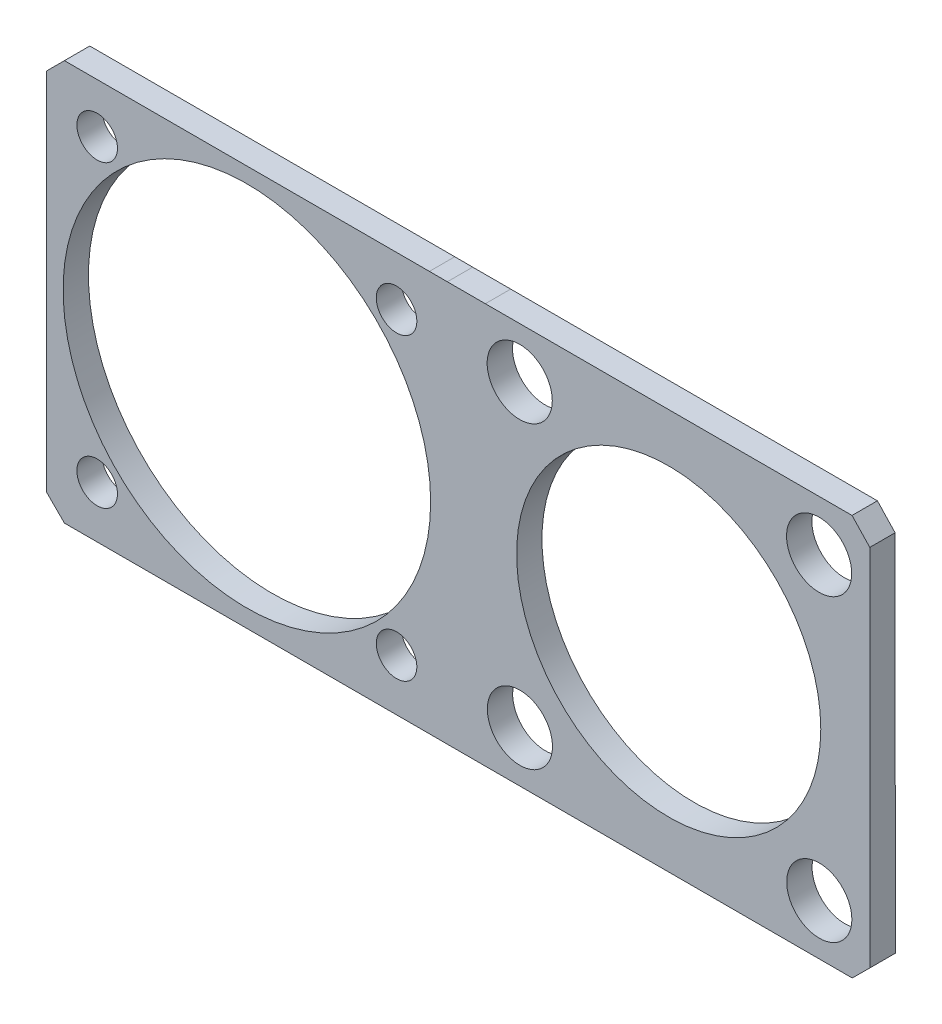
ISO-10303-21;
HEADER;
FILE_DESCRIPTION(('STEP AP214'),'2;1');
FILE_NAME('part.step','',(''),(''),'','','');
FILE_SCHEMA(('AUTOMOTIVE_DESIGN { 1 0 10303 214 1 1 1 1 }'));
ENDSEC;
DATA;
#1=APPLICATION_CONTEXT('core data for automotive mechanical design processes');
#2=APPLICATION_PROTOCOL_DEFINITION('international standard','automotive_design',2000,#1);
#3=PRODUCT_CONTEXT('',#1,'mechanical');
#4=PRODUCT('Part','Part','',(#3));
#5=PRODUCT_RELATED_PRODUCT_CATEGORY('part','',(#4));
#6=PRODUCT_DEFINITION_FORMATION('','',#4);
#7=PRODUCT_DEFINITION_CONTEXT('part definition',#1,'design');
#8=PRODUCT_DEFINITION('design','',#6,#7);
#9=PRODUCT_DEFINITION_SHAPE('','',#8);
#10=(LENGTH_UNIT() NAMED_UNIT(*) SI_UNIT(.MILLI.,.METRE.));
#11=(NAMED_UNIT(*) PLANE_ANGLE_UNIT() SI_UNIT($,.RADIAN.));
#12=(NAMED_UNIT(*) SI_UNIT($,.STERADIAN.) SOLID_ANGLE_UNIT());
#13=UNCERTAINTY_MEASURE_WITH_UNIT(LENGTH_MEASURE(1.E-05),#10,'distance_accuracy_value','');
#14=(GEOMETRIC_REPRESENTATION_CONTEXT(3) GLOBAL_UNCERTAINTY_ASSIGNED_CONTEXT((#13)) GLOBAL_UNIT_ASSIGNED_CONTEXT((#10,
#11,#12)) REPRESENTATION_CONTEXT('',''));
#15=CARTESIAN_POINT('',(0.,0.,0.));
#16=DIRECTION('',(0.,0.,1.));
#17=DIRECTION('',(1.,0.,0.));
#18=AXIS2_PLACEMENT_3D('',#15,#16,#17);
#19=CARTESIAN_POINT('',(0.,-20.1814452506388,-2.54));
#20=DIRECTION('',(0.,-1.,0.));
#21=DIRECTION('',(0.,0.,-1.));
#22=AXIS2_PLACEMENT_3D('',#19,#20,#21);
#23=PLANE('',#22);
#24=DIRECTION('',(1.,0.,0.));
#25=VECTOR('',#24,1.);
#26=CARTESIAN_POINT('',(0.,-20.1814452506388,0.));
#27=LINE('',#26,#25);
#28=CARTESIAN_POINT('',(20.066,-20.1814452506388,0.));
#29=VERTEX_POINT('',#28);
#30=CARTESIAN_POINT('',(60.660238164582,-20.1814452506388,0.));
#31=VERTEX_POINT('',#30);
#32=EDGE_CURVE('E215',#29,#31,#27,.T.);
#33=ORIENTED_EDGE('',*,*,#32,.F.);
#34=DIRECTION('',(0.,0.,1.));
#35=VECTOR('',#34,1.);
#36=CARTESIAN_POINT('',(20.066,-20.1814452506388,-2.54));
#37=LINE('',#36,#35);
#38=CARTESIAN_POINT('',(20.066,-20.1814452506388,-2.54));
#39=VERTEX_POINT('',#38);
#40=EDGE_CURVE('E11',#39,#29,#37,.T.);
#41=ORIENTED_EDGE('',*,*,#40,.F.);
#42=DIRECTION('',(1.,0.,0.));
#43=VECTOR('',#42,1.);
#44=CARTESIAN_POINT('',(0.,-20.1814452506388,-2.54));
#45=LINE('',#44,#43);
#46=CARTESIAN_POINT('',(60.660238164582,-20.1814452506388,-2.54));
#47=VERTEX_POINT('',#46);
#48=EDGE_CURVE('E293',#39,#47,#45,.T.);
#49=ORIENTED_EDGE('',*,*,#48,.T.);
#50=DIRECTION('',(0.,0.,1.));
#51=VECTOR('',#50,1.);
#52=CARTESIAN_POINT('',(60.660238164582,-20.1814452506388,-2.54));
#53=LINE('',#52,#51);
#54=EDGE_CURVE('E45',#47,#31,#53,.T.);
#55=ORIENTED_EDGE('',*,*,#54,.T.);
#56=EDGE_LOOP('',(#33,#41,#49,#55));
#57=FACE_BOUND('',#56,.T.);
#58=ADVANCED_FACE('F41',(#57),#23,.T.);
#59=CARTESIAN_POINT('',(-0.0561228319052938,-20.1253313662649,-2.54));
#60=DIRECTION('',(-0.00278865538465469,-0.999996111693013,0.));
#61=DIRECTION('',(0.999996111693013,-0.00278865538465469,0.));
#62=AXIS2_PLACEMENT_3D('',#59,#60,#61);
#63=PLANE('',#62);
#64=DIRECTION('',(0.999996111693014,-0.00278865538465469,0.));
#65=VECTOR('',#64,1.);
#66=CARTESIAN_POINT('',(-0.0561228319052938,-20.1253313662649,0.));
#67=LINE('',#66,#65);
#68=CARTESIAN_POINT('',(18.2929444601042,-20.1765007905346,0.));
#69=VERTEX_POINT('',#68);
#70=EDGE_CURVE('E260',#69,#29,#67,.T.);
#71=ORIENTED_EDGE('',*,*,#70,.F.);
#72=DIRECTION('',(0.,0.,1.));
#73=VECTOR('',#72,1.);
#74=CARTESIAN_POINT('',(18.2929444601042,-20.1765007905346,-2.54));
#75=LINE('',#74,#73);
#76=CARTESIAN_POINT('',(18.2929444601042,-20.1765007905346,-2.54));
#77=VERTEX_POINT('',#76);
#78=EDGE_CURVE('E52',#77,#69,#75,.T.);
#79=ORIENTED_EDGE('',*,*,#78,.F.);
#80=DIRECTION('',(0.999996111693014,-0.00278865538465469,0.));
#81=VECTOR('',#80,1.);
#82=CARTESIAN_POINT('',(-0.0561228319052938,-20.1253313662649,-2.54));
#83=LINE('',#82,#81);
#84=EDGE_CURVE('E161',#77,#39,#83,.T.);
#85=ORIENTED_EDGE('',*,*,#84,.T.);
#86=ORIENTED_EDGE('',*,*,#40,.T.);
#87=EDGE_LOOP('',(#71,#79,#85,#86));
#88=FACE_BOUND('',#87,.T.);
#89=ADVANCED_FACE('F297',(#88),#63,.T.);
#90=CARTESIAN_POINT('',(0.,-20.1765007905346,-2.54));
#91=DIRECTION('',(0.,-1.,0.));
#92=DIRECTION('',(0.,0.,-1.));
#93=AXIS2_PLACEMENT_3D('',#90,#91,#92);
#94=PLANE('',#93);
#95=DIRECTION('',(1.,0.,0.));
#96=VECTOR('',#95,1.);
#97=CARTESIAN_POINT('',(0.,-20.1765007905346,0.));
#98=LINE('',#97,#96);
#99=CARTESIAN_POINT('',(-18.2830555398958,-20.1765007905345,0.));
#100=VERTEX_POINT('',#99);
#101=EDGE_CURVE('E147',#100,#69,#98,.T.);
#102=ORIENTED_EDGE('',*,*,#101,.F.);
#103=DIRECTION('',(0.,0.,1.));
#104=VECTOR('',#103,1.);
#105=CARTESIAN_POINT('',(-18.2830555398958,-20.1765007905345,-2.54));
#106=LINE('',#105,#104);
#107=CARTESIAN_POINT('',(-18.2830555398958,-20.1765007905345,-2.54));
#108=VERTEX_POINT('',#107);
#109=EDGE_CURVE('E142',#108,#100,#106,.T.);
#110=ORIENTED_EDGE('',*,*,#109,.F.);
#111=DIRECTION('',(1.,0.,0.));
#112=VECTOR('',#111,1.);
#113=CARTESIAN_POINT('',(0.,-20.1765007905346,-2.54));
#114=LINE('',#113,#112);
#115=EDGE_CURVE('E145',#108,#77,#114,.T.);
#116=ORIENTED_EDGE('',*,*,#115,.T.);
#117=ORIENTED_EDGE('',*,*,#78,.T.);
#118=EDGE_LOOP('',(#102,#110,#116,#117));
#119=FACE_BOUND('',#118,.T.);
#120=ADVANCED_FACE('F144',(#119),#94,.T.);
#121=CARTESIAN_POINT('',(-19.2297781652152,-19.2297781652152,-2.54));
#122=DIRECTION('',(-0.707106781186548,-0.707106781186548,0.));
#123=DIRECTION('',(0.707106781186548,-0.707106781186548,0.));
#124=AXIS2_PLACEMENT_3D('',#121,#122,#123);
#125=PLANE('',#124);
#126=DIRECTION('',(0.707106781186548,-0.707106781186548,0.));
#127=VECTOR('',#126,1.);
#128=CARTESIAN_POINT('',(-19.2297781652152,-19.2297781652152,0.));
#129=LINE('',#128,#127);
#130=CARTESIAN_POINT('',(-20.0610555398958,-18.3985007905345,0.));
#131=VERTEX_POINT('',#130);
#132=EDGE_CURVE('E255',#131,#100,#129,.T.);
#133=ORIENTED_EDGE('',*,*,#132,.F.);
#134=DIRECTION('',(0.,0.,1.));
#135=VECTOR('',#134,1.);
#136=CARTESIAN_POINT('',(-20.0610555398958,-18.3985007905345,-2.54));
#137=LINE('',#136,#135);
#138=CARTESIAN_POINT('',(-20.0610555398958,-18.3985007905345,-2.54));
#139=VERTEX_POINT('',#138);
#140=EDGE_CURVE('E153',#139,#131,#137,.T.);
#141=ORIENTED_EDGE('',*,*,#140,.F.);
#142=DIRECTION('',(0.707106781186548,-0.707106781186548,0.));
#143=VECTOR('',#142,1.);
#144=CARTESIAN_POINT('',(-19.2297781652152,-19.2297781652152,-2.54));
#145=LINE('',#144,#143);
#146=EDGE_CURVE('E159',#139,#108,#145,.T.);
#147=ORIENTED_EDGE('',*,*,#146,.T.);
#148=ORIENTED_EDGE('',*,*,#109,.T.);
#149=EDGE_LOOP('',(#133,#141,#147,#148));
#150=FACE_BOUND('',#149,.T.);
#151=ADVANCED_FACE('F164',(#150),#125,.T.);
#152=CARTESIAN_POINT('',(-20.0610555398958,0.,-2.54));
#153=DIRECTION('',(-1.,0.,0.));
#154=DIRECTION('',(0.,0.,1.));
#155=AXIS2_PLACEMENT_3D('',#152,#153,#154);
#156=PLANE('',#155);
#157=DIRECTION('',(0.,-1.,0.));
#158=VECTOR('',#157,1.);
#159=CARTESIAN_POINT('',(-20.0610555398958,0.,0.));
#160=LINE('',#159,#158);
#161=CARTESIAN_POINT('',(-20.0610555398958,18.1774992094654,0.));
#162=VERTEX_POINT('',#161);
#163=EDGE_CURVE('E251',#162,#131,#160,.T.);
#164=ORIENTED_EDGE('',*,*,#163,.F.);
#165=DIRECTION('',(0.,0.,1.));
#166=VECTOR('',#165,1.);
#167=CARTESIAN_POINT('',(-20.0610555398958,18.1774992094654,-2.54));
#168=LINE('',#167,#166);
#169=CARTESIAN_POINT('',(-20.0610555398958,18.1774992094654,-2.54));
#170=VERTEX_POINT('',#169);
#171=EDGE_CURVE('E269',#170,#162,#168,.T.);
#172=ORIENTED_EDGE('',*,*,#171,.F.);
#173=DIRECTION('',(0.,-1.,0.));
#174=VECTOR('',#173,1.);
#175=CARTESIAN_POINT('',(-20.0610555398958,0.,-2.54));
#176=LINE('',#175,#174);
#177=EDGE_CURVE('E166',#170,#139,#176,.T.);
#178=ORIENTED_EDGE('',*,*,#177,.T.);
#179=ORIENTED_EDGE('',*,*,#140,.T.);
#180=EDGE_LOOP('',(#164,#172,#178,#179));
#181=FACE_BOUND('',#180,.T.);
#182=ADVANCED_FACE('F311',(#181),#156,.T.);
#183=CARTESIAN_POINT('',(-19.1192773746806,19.1192773746806,-2.54));
#184=DIRECTION('',(-0.707106781186548,0.707106781186548,0.));
#185=DIRECTION('',(-0.707106781186548,-0.707106781186548,0.));
#186=AXIS2_PLACEMENT_3D('',#183,#184,#185);
#187=PLANE('',#186);
#188=DIRECTION('',(-0.707106781186548,-0.707106781186548,0.));
#189=VECTOR('',#188,1.);
#190=CARTESIAN_POINT('',(-19.1192773746806,19.1192773746806,0.));
#191=LINE('',#190,#189);
#192=CARTESIAN_POINT('',(-18.2830555398958,19.9554992094655,0.));
#193=VERTEX_POINT('',#192);
#194=EDGE_CURVE('E247',#193,#162,#191,.T.);
#195=ORIENTED_EDGE('',*,*,#194,.F.);
#196=DIRECTION('',(0.,0.,1.));
#197=VECTOR('',#196,1.);
#198=CARTESIAN_POINT('',(-18.2830555398958,19.9554992094655,-2.54));
#199=LINE('',#198,#197);
#200=CARTESIAN_POINT('',(-18.2830555398958,19.9554992094655,-2.54));
#201=VERTEX_POINT('',#200);
#202=EDGE_CURVE('E272',#201,#193,#199,.T.);
#203=ORIENTED_EDGE('',*,*,#202,.F.);
#204=DIRECTION('',(-0.707106781186548,-0.707106781186548,0.));
#205=VECTOR('',#204,1.);
#206=CARTESIAN_POINT('',(-19.1192773746806,19.1192773746806,-2.54));
#207=LINE('',#206,#205);
#208=EDGE_CURVE('E169',#201,#170,#207,.T.);
#209=ORIENTED_EDGE('',*,*,#208,.T.);
#210=ORIENTED_EDGE('',*,*,#171,.T.);
#211=EDGE_LOOP('',(#195,#203,#209,#210));
#212=FACE_BOUND('',#211,.T.);
#213=ADVANCED_FACE('F314',(#212),#187,.T.);
#214=CARTESIAN_POINT('',(0.,19.9554992094655,-2.54));
#215=DIRECTION('',(0.,1.,0.));
#216=DIRECTION('',(0.,0.,1.));
#217=AXIS2_PLACEMENT_3D('',#214,#215,#216);
#218=PLANE('',#217);
#219=DIRECTION('',(-1.,0.,0.));
#220=VECTOR('',#219,1.);
#221=CARTESIAN_POINT('',(0.,19.9554992094655,0.));
#222=LINE('',#221,#220);
#223=CARTESIAN_POINT('',(18.2929444601042,19.9554992094655,0.));
#224=VERTEX_POINT('',#223);
#225=EDGE_CURVE('E243',#224,#193,#222,.T.);
#226=ORIENTED_EDGE('',*,*,#225,.F.);
#227=DIRECTION('',(0.,0.,1.));
#228=VECTOR('',#227,1.);
#229=CARTESIAN_POINT('',(18.2929444601042,19.9554992094655,-2.54));
#230=LINE('',#229,#228);
#231=CARTESIAN_POINT('',(18.2929444601042,19.9554992094655,-2.54));
#232=VERTEX_POINT('',#231);
#233=EDGE_CURVE('E275',#232,#224,#230,.T.);
#234=ORIENTED_EDGE('',*,*,#233,.F.);
#235=DIRECTION('',(-1.,0.,0.));
#236=VECTOR('',#235,1.);
#237=CARTESIAN_POINT('',(0.,19.9554992094655,-2.54));
#238=LINE('',#237,#236);
#239=EDGE_CURVE('E489',#232,#201,#238,.T.);
#240=ORIENTED_EDGE('',*,*,#239,.T.);
#241=ORIENTED_EDGE('',*,*,#202,.T.);
#242=EDGE_LOOP('',(#226,#234,#240,#241));
#243=FACE_BOUND('',#242,.T.);
#244=ADVANCED_FACE('F318',(#243),#218,.T.);
#245=CARTESIAN_POINT('',(0.0557910508343836,20.0063565432699,-2.54));
#246=DIRECTION('',(0.00278865538465168,0.999996111693013,0.));
#247=DIRECTION('',(-0.999996111693013,0.00278865538465168,0.));
#248=AXIS2_PLACEMENT_3D('',#245,#246,#247);
#249=PLANE('',#248);
#250=DIRECTION('',(-0.999996111693014,0.00278865538465168,0.));
#251=VECTOR('',#250,1.);
#252=CARTESIAN_POINT('',(0.0557910508343836,20.0063565432699,0.));
#253=LINE('',#252,#251);
#254=CARTESIAN_POINT('',(20.085777840816,19.9504995955645,0.));
#255=VERTEX_POINT('',#254);
#256=EDGE_CURVE('E239',#255,#224,#253,.T.);
#257=ORIENTED_EDGE('',*,*,#256,.F.);
#258=DIRECTION('',(0.,0.,1.));
#259=VECTOR('',#258,1.);
#260=CARTESIAN_POINT('',(20.085777840816,19.9504995955645,-2.54));
#261=LINE('',#260,#259);
#262=CARTESIAN_POINT('',(20.085777840816,19.9504995955645,-2.54));
#263=VERTEX_POINT('',#262);
#264=EDGE_CURVE('E278',#263,#255,#261,.T.);
#265=ORIENTED_EDGE('',*,*,#264,.F.);
#266=DIRECTION('',(-0.999996111693014,0.00278865538465168,0.));
#267=VECTOR('',#266,1.);
#268=CARTESIAN_POINT('',(0.0557910508343836,20.0063565432699,-2.54));
#269=LINE('',#268,#267);
#270=EDGE_CURVE('E485',#263,#232,#269,.T.);
#271=ORIENTED_EDGE('',*,*,#270,.T.);
#272=ORIENTED_EDGE('',*,*,#233,.T.);
#273=EDGE_LOOP('',(#257,#265,#271,#272));
#274=FACE_BOUND('',#273,.T.);
#275=ADVANCED_FACE('F322',(#274),#249,.T.);
#276=CARTESIAN_POINT('',(-0.000288800462674114,19.9502088284157,-2.54));
#277=DIRECTION('',(-1.44760621368788E-05,0.999999999895222,0.));
#278=DIRECTION('',(-0.999999999895222,-1.44760621368788E-05,0.));
#279=AXIS2_PLACEMENT_3D('',#276,#277,#278);
#280=PLANE('',#279);
#281=DIRECTION('',(-0.999999999895222,-1.44760621368788E-05,0.));
#282=VECTOR('',#281,1.);
#283=CARTESIAN_POINT('',(-0.000288800462674114,19.9502088284157,0.));
#284=LINE('',#283,#282);
#285=CARTESIAN_POINT('',(23.8957778404168,19.9505547493613,0.));
#286=VERTEX_POINT('',#285);
#287=EDGE_CURVE('E235',#286,#255,#284,.T.);
#288=ORIENTED_EDGE('',*,*,#287,.F.);
#289=DIRECTION('',(0.,0.,1.));
#290=VECTOR('',#289,1.);
#291=CARTESIAN_POINT('',(23.8957778404168,19.9505547493613,-2.54));
#292=LINE('',#291,#290);
#293=CARTESIAN_POINT('',(23.8957778404168,19.9505547493613,-2.54));
#294=VERTEX_POINT('',#293);
#295=EDGE_CURVE('E281',#294,#286,#292,.T.);
#296=ORIENTED_EDGE('',*,*,#295,.F.);
#297=DIRECTION('',(-0.999999999895222,-1.44760621368788E-05,0.));
#298=VECTOR('',#297,1.);
#299=CARTESIAN_POINT('',(-0.000288800462674114,19.9502088284157,-2.54));
#300=LINE('',#299,#298);
#301=EDGE_CURVE('E481',#294,#263,#300,.T.);
#302=ORIENTED_EDGE('',*,*,#301,.T.);
#303=ORIENTED_EDGE('',*,*,#264,.T.);
#304=EDGE_LOOP('',(#288,#296,#302,#303));
#305=FACE_BOUND('',#304,.T.);
#306=ADVANCED_FACE('F326',(#305),#280,.T.);
#307=CARTESIAN_POINT('',(0.,19.9505547493613,-2.54));
#308=DIRECTION('',(0.,1.,0.));
#309=DIRECTION('',(0.,0.,1.));
#310=AXIS2_PLACEMENT_3D('',#307,#308,#309);
#311=PLANE('',#310);
#312=DIRECTION('',(-1.,0.,0.));
#313=VECTOR('',#312,1.);
#314=CARTESIAN_POINT('',(0.,19.9505547493613,0.));
#315=LINE('',#314,#313);
#316=CARTESIAN_POINT('',(60.6404603241651,19.9505547493613,0.));
#317=VERTEX_POINT('',#316);
#318=EDGE_CURVE('E231',#317,#286,#315,.T.);
#319=ORIENTED_EDGE('',*,*,#318,.F.);
#320=DIRECTION('',(0.,0.,1.));
#321=VECTOR('',#320,1.);
#322=CARTESIAN_POINT('',(60.6404603241651,19.9505547493613,-2.54));
#323=LINE('',#322,#321);
#324=CARTESIAN_POINT('',(60.6404603241651,19.9505547493613,-2.54));
#325=VERTEX_POINT('',#324);
#326=EDGE_CURVE('E284',#325,#317,#323,.T.);
#327=ORIENTED_EDGE('',*,*,#326,.F.);
#328=DIRECTION('',(-1.,0.,0.));
#329=VECTOR('',#328,1.);
#330=CARTESIAN_POINT('',(0.,19.9505547493613,-2.54));
#331=LINE('',#330,#329);
#332=EDGE_CURVE('E477',#325,#294,#331,.T.);
#333=ORIENTED_EDGE('',*,*,#332,.T.);
#334=ORIENTED_EDGE('',*,*,#295,.T.);
#335=EDGE_LOOP('',(#319,#327,#333,#334));
#336=FACE_BOUND('',#335,.T.);
#337=ADVANCED_FACE('F330',(#336),#311,.T.);
#338=CARTESIAN_POINT('',(42.0341718604599,39.6671295511699,-2.54));
#339=DIRECTION('',(0.727287843154192,0.686332567491973,0.));
#340=DIRECTION('',(-0.686332567491973,0.727287843154192,0.));
#341=AXIS2_PLACEMENT_3D('',#338,#339,#340);
#342=PLANE('',#341);
#343=DIRECTION('',(-0.686332567491973,0.727287843154192,0.));
#344=VECTOR('',#343,1.);
#345=CARTESIAN_POINT('',(42.0341718604599,39.6671295511699,0.));
#346=LINE('',#345,#344);
#347=CARTESIAN_POINT('',(62.4184603241651,18.0664567968868,0.));
#348=VERTEX_POINT('',#347);
#349=EDGE_CURVE('E227',#348,#317,#346,.T.);
#350=ORIENTED_EDGE('',*,*,#349,.F.);
#351=DIRECTION('',(0.,0.,1.));
#352=VECTOR('',#351,1.);
#353=CARTESIAN_POINT('',(62.4184603241651,18.0664567968868,-2.54));
#354=LINE('',#353,#352);
#355=CARTESIAN_POINT('',(62.4184603241651,18.0664567968868,-2.54));
#356=VERTEX_POINT('',#355);
#357=EDGE_CURVE('E287',#356,#348,#354,.T.);
#358=ORIENTED_EDGE('',*,*,#357,.F.);
#359=DIRECTION('',(-0.686332567491973,0.727287843154192,0.));
#360=VECTOR('',#359,1.);
#361=CARTESIAN_POINT('',(42.0341718604599,39.6671295511699,-2.54));
#362=LINE('',#361,#360);
#363=EDGE_CURVE('E473',#356,#325,#362,.T.);
#364=ORIENTED_EDGE('',*,*,#363,.T.);
#365=ORIENTED_EDGE('',*,*,#326,.T.);
#366=EDGE_LOOP('',(#350,#358,#364,#365));
#367=FACE_BOUND('',#366,.T.);
#368=ADVANCED_FACE('F334',(#367),#342,.T.);
#369=CARTESIAN_POINT('',(62.4282367592248,0.0338456587284659,-2.54));
#370=DIRECTION('',(0.99999985303507,0.000542152966531443,0.));
#371=DIRECTION('',(-0.000542152966531443,0.99999985303507,0.));
#372=AXIS2_PLACEMENT_3D('',#369,#370,#371);
#373=PLANE('',#372);
#374=DIRECTION('',(-0.000542152966531443,0.99999985303507,0.));
#375=VECTOR('',#374,1.);
#376=CARTESIAN_POINT('',(62.4282367592248,0.0338456587284659,0.));
#377=LINE('',#376,#375);
#378=CARTESIAN_POINT('',(62.438238164582,-18.4137226564092,0.));
#379=VERTEX_POINT('',#378);
#380=EDGE_CURVE('E223',#379,#348,#377,.T.);
#381=ORIENTED_EDGE('',*,*,#380,.F.);
#382=DIRECTION('',(0.,0.,1.));
#383=VECTOR('',#382,1.);
#384=CARTESIAN_POINT('',(62.438238164582,-18.4137226564092,-2.54));
#385=LINE('',#384,#383);
#386=CARTESIAN_POINT('',(62.438238164582,-18.4137226564092,-2.54));
#387=VERTEX_POINT('',#386);
#388=EDGE_CURVE('E289',#387,#379,#385,.T.);
#389=ORIENTED_EDGE('',*,*,#388,.F.);
#390=DIRECTION('',(-0.000542152966531443,0.99999985303507,0.));
#391=VECTOR('',#390,1.);
#392=CARTESIAN_POINT('',(62.4282367592248,0.0338456587284659,-2.54));
#393=LINE('',#392,#391);
#394=EDGE_CURVE('E469',#387,#356,#393,.T.);
#395=ORIENTED_EDGE('',*,*,#394,.T.);
#396=ORIENTED_EDGE('',*,*,#357,.T.);
#397=EDGE_LOOP('',(#381,#389,#395,#396));
#398=FACE_BOUND('',#397,.T.);
#399=ADVANCED_FACE('F338',(#398),#373,.T.);
#400=CARTESIAN_POINT('',(-14.99997,14.99997,-2.54));
#401=DIRECTION('',(0.,0.,1.));
#402=DIRECTION('',(1.,0.,0.));
#403=AXIS2_PLACEMENT_3D('',#400,#401,#402);
#404=CYLINDRICAL_SURFACE('',#403,2.032);
#405=CARTESIAN_POINT('',(-14.99997,14.99997,-2.54));
#406=DIRECTION('',(0.,0.,1.));
#407=DIRECTION('',(1.,0.,0.));
#408=AXIS2_PLACEMENT_3D('',#405,#406,#407);
#409=CIRCLE('',#408,2.032);
#410=CARTESIAN_POINT('',(-12.96797,14.99997,-2.54));
#411=VERTEX_POINT('',#410);
#412=EDGE_CURVE('E457',#411,#411,#409,.T.);
#413=ORIENTED_EDGE('',*,*,#412,.F.);
#414=EDGE_LOOP('',(#413));
#415=FACE_BOUND('',#414,.T.);
#416=CARTESIAN_POINT('',(-14.99997,14.99997,0.));
#417=DIRECTION('',(0.,0.,1.));
#418=DIRECTION('',(1.,0.,0.));
#419=AXIS2_PLACEMENT_3D('',#416,#417,#418);
#420=CIRCLE('',#419,2.032);
#421=CARTESIAN_POINT('',(-12.96797,14.99997,0.));
#422=VERTEX_POINT('',#421);
#423=EDGE_CURVE('E211',#422,#422,#420,.T.);
#424=ORIENTED_EDGE('',*,*,#423,.T.);
#425=EDGE_LOOP('',(#424));
#426=FACE_BOUND('',#425,.T.);
#427=ADVANCED_FACE('F342',(#415,#426),#404,.F.);
#428=CARTESIAN_POINT('',(14.99997,14.99997,-2.54));
#429=DIRECTION('',(0.,0.,1.));
#430=DIRECTION('',(1.,0.,0.));
#431=AXIS2_PLACEMENT_3D('',#428,#429,#430);
#432=CYLINDRICAL_SURFACE('',#431,2.032);
#433=CARTESIAN_POINT('',(14.99997,14.99997,-2.54));
#434=DIRECTION('',(0.,0.,1.));
#435=DIRECTION('',(1.,0.,0.));
#436=AXIS2_PLACEMENT_3D('',#433,#434,#435);
#437=CIRCLE('',#436,2.032);
#438=CARTESIAN_POINT('',(17.03197,14.99997,-2.54));
#439=VERTEX_POINT('',#438);
#440=EDGE_CURVE('E454',#439,#439,#437,.T.);
#441=ORIENTED_EDGE('',*,*,#440,.F.);
#442=EDGE_LOOP('',(#441));
#443=FACE_BOUND('',#442,.T.);
#444=CARTESIAN_POINT('',(14.99997,14.99997,0.));
#445=DIRECTION('',(0.,0.,1.));
#446=DIRECTION('',(1.,0.,0.));
#447=AXIS2_PLACEMENT_3D('',#444,#445,#446);
#448=CIRCLE('',#447,2.032);
#449=CARTESIAN_POINT('',(17.03197,14.99997,0.));
#450=VERTEX_POINT('',#449);
#451=EDGE_CURVE('E207',#450,#450,#448,.T.);
#452=ORIENTED_EDGE('',*,*,#451,.T.);
#453=EDGE_LOOP('',(#452));
#454=FACE_BOUND('',#453,.T.);
#455=ADVANCED_FACE('F348',(#443,#454),#432,.F.);
#456=CARTESIAN_POINT('',(-14.99997,-14.99997,-2.54));
#457=DIRECTION('',(0.,0.,1.));
#458=DIRECTION('',(1.,0.,0.));
#459=AXIS2_PLACEMENT_3D('',#456,#457,#458);
#460=CYLINDRICAL_SURFACE('',#459,2.032);
#461=CARTESIAN_POINT('',(-14.99997,-14.99997,-2.54));
#462=DIRECTION('',(0.,0.,1.));
#463=DIRECTION('',(1.,0.,0.));
#464=AXIS2_PLACEMENT_3D('',#461,#462,#463);
#465=CIRCLE('',#464,2.032);
#466=CARTESIAN_POINT('',(-12.96797,-14.99997,-2.54));
#467=VERTEX_POINT('',#466);
#468=EDGE_CURVE('E450',#467,#467,#465,.T.);
#469=ORIENTED_EDGE('',*,*,#468,.F.);
#470=EDGE_LOOP('',(#469));
#471=FACE_BOUND('',#470,.T.);
#472=CARTESIAN_POINT('',(-14.99997,-14.99997,0.));
#473=DIRECTION('',(0.,0.,1.));
#474=DIRECTION('',(1.,0.,0.));
#475=AXIS2_PLACEMENT_3D('',#472,#473,#474);
#476=CIRCLE('',#475,2.032);
#477=CARTESIAN_POINT('',(-12.96797,-14.99997,0.));
#478=VERTEX_POINT('',#477);
#479=EDGE_CURVE('E203',#478,#478,#476,.T.);
#480=ORIENTED_EDGE('',*,*,#479,.T.);
#481=EDGE_LOOP('',(#480));
#482=FACE_BOUND('',#481,.T.);
#483=ADVANCED_FACE('F352',(#471,#482),#460,.F.);
#484=CARTESIAN_POINT('',(14.99997,-14.99997,-2.54));
#485=DIRECTION('',(0.,0.,1.));
#486=DIRECTION('',(1.,0.,0.));
#487=AXIS2_PLACEMENT_3D('',#484,#485,#486);
#488=CYLINDRICAL_SURFACE('',#487,2.032);
#489=CARTESIAN_POINT('',(14.99997,-14.99997,-2.54));
#490=DIRECTION('',(0.,0.,1.));
#491=DIRECTION('',(1.,0.,0.));
#492=AXIS2_PLACEMENT_3D('',#489,#490,#491);
#493=CIRCLE('',#492,2.032);
#494=CARTESIAN_POINT('',(17.03197,-14.99997,-2.54));
#495=VERTEX_POINT('',#494);
#496=EDGE_CURVE('E446',#495,#495,#493,.T.);
#497=ORIENTED_EDGE('',*,*,#496,.F.);
#498=EDGE_LOOP('',(#497));
#499=FACE_BOUND('',#498,.T.);
#500=CARTESIAN_POINT('',(14.99997,-14.99997,0.));
#501=DIRECTION('',(0.,0.,1.));
#502=DIRECTION('',(1.,0.,0.));
#503=AXIS2_PLACEMENT_3D('',#500,#501,#502);
#504=CIRCLE('',#503,2.032);
#505=CARTESIAN_POINT('',(17.03197,-14.99997,0.));
#506=VERTEX_POINT('',#505);
#507=EDGE_CURVE('E199',#506,#506,#504,.T.);
#508=ORIENTED_EDGE('',*,*,#507,.T.);
#509=EDGE_LOOP('',(#508));
#510=FACE_BOUND('',#509,.T.);
#511=ADVANCED_FACE('F356',(#499,#510),#488,.F.);
#512=CARTESIAN_POINT('',(27.3402446746811,14.8845247493612,-2.54));
#513=DIRECTION('',(0.,0.,1.));
#514=DIRECTION('',(1.,0.,0.));
#515=AXIS2_PLACEMENT_3D('',#512,#513,#514);
#516=CYLINDRICAL_SURFACE('',#515,3.26389999999998);
#517=CARTESIAN_POINT('',(27.3402446746811,14.8845247493612,-2.54));
#518=DIRECTION('',(0.,0.,1.));
#519=DIRECTION('',(1.,0.,0.));
#520=AXIS2_PLACEMENT_3D('',#517,#518,#519);
#521=CIRCLE('',#520,3.26389999999998);
#522=CARTESIAN_POINT('',(30.6041446746811,14.8845247493612,-2.54));
#523=VERTEX_POINT('',#522);
#524=EDGE_CURVE('E442',#523,#523,#521,.T.);
#525=ORIENTED_EDGE('',*,*,#524,.F.);
#526=EDGE_LOOP('',(#525));
#527=FACE_BOUND('',#526,.T.);
#528=CARTESIAN_POINT('',(27.3402446746811,14.8845247493612,0.));
#529=DIRECTION('',(0.,0.,1.));
#530=DIRECTION('',(1.,0.,0.));
#531=AXIS2_PLACEMENT_3D('',#528,#529,#530);
#532=CIRCLE('',#531,3.26389999999998);
#533=CARTESIAN_POINT('',(30.6041446746811,14.8845247493612,0.));
#534=VERTEX_POINT('',#533);
#535=EDGE_CURVE('E195',#534,#534,#532,.T.);
#536=ORIENTED_EDGE('',*,*,#535,.T.);
#537=EDGE_LOOP('',(#536));
#538=FACE_BOUND('',#537,.T.);
#539=ADVANCED_FACE('F360',(#527,#538),#516,.F.);
#540=CARTESIAN_POINT('',(57.3401846746806,14.8845193172082,-2.54));
#541=DIRECTION('',(0.,0.,1.));
#542=DIRECTION('',(1.,0.,0.));
#543=AXIS2_PLACEMENT_3D('',#540,#541,#542);
#544=CYLINDRICAL_SURFACE('',#543,3.26389999999998);
#545=CARTESIAN_POINT('',(57.3401846746806,14.8845193172082,-2.54));
#546=DIRECTION('',(0.,0.,1.));
#547=DIRECTION('',(1.,0.,0.));
#548=AXIS2_PLACEMENT_3D('',#545,#546,#547);
#549=CIRCLE('',#548,3.26389999999998);
#550=CARTESIAN_POINT('',(60.6040846746806,14.8845193172082,-2.54));
#551=VERTEX_POINT('',#550);
#552=EDGE_CURVE('E438',#551,#551,#549,.T.);
#553=ORIENTED_EDGE('',*,*,#552,.F.);
#554=EDGE_LOOP('',(#553));
#555=FACE_BOUND('',#554,.T.);
#556=CARTESIAN_POINT('',(57.3401846746806,14.8845193172082,0.));
#557=DIRECTION('',(0.,0.,1.));
#558=DIRECTION('',(1.,0.,0.));
#559=AXIS2_PLACEMENT_3D('',#556,#557,#558);
#560=CIRCLE('',#559,3.26389999999998);
#561=CARTESIAN_POINT('',(60.6040846746806,14.8845193172082,0.));
#562=VERTEX_POINT('',#561);
#563=EDGE_CURVE('E191',#562,#562,#560,.T.);
#564=ORIENTED_EDGE('',*,*,#563,.T.);
#565=EDGE_LOOP('',(#564));
#566=FACE_BOUND('',#565,.T.);
#567=ADVANCED_FACE('F364',(#555,#566),#544,.F.);
#568=CARTESIAN_POINT('',(27.358298164582,-15.1154152506388,-2.54));
#569=DIRECTION('',(0.,0.,1.));
#570=DIRECTION('',(1.,0.,0.));
#571=AXIS2_PLACEMENT_3D('',#568,#569,#570);
#572=CYLINDRICAL_SURFACE('',#571,3.26389999999998);
#573=CARTESIAN_POINT('',(27.358298164582,-15.1154152506388,-2.54));
#574=DIRECTION('',(0.,0.,1.));
#575=DIRECTION('',(1.,0.,0.));
#576=AXIS2_PLACEMENT_3D('',#573,#574,#575);
#577=CIRCLE('',#576,3.26389999999998);
#578=CARTESIAN_POINT('',(30.6221981645819,-15.1154152506388,-2.54));
#579=VERTEX_POINT('',#578);
#580=EDGE_CURVE('E434',#579,#579,#577,.T.);
#581=ORIENTED_EDGE('',*,*,#580,.F.);
#582=EDGE_LOOP('',(#581));
#583=FACE_BOUND('',#582,.T.);
#584=CARTESIAN_POINT('',(27.358298164582,-15.1154152506388,0.));
#585=DIRECTION('',(0.,0.,1.));
#586=DIRECTION('',(1.,0.,0.));
#587=AXIS2_PLACEMENT_3D('',#584,#585,#586);
#588=CIRCLE('',#587,3.26389999999998);
#589=CARTESIAN_POINT('',(30.6221981645819,-15.1154152506388,0.));
#590=VERTEX_POINT('',#589);
#591=EDGE_CURVE('E187',#590,#590,#588,.T.);
#592=ORIENTED_EDGE('',*,*,#591,.T.);
#593=EDGE_LOOP('',(#592));
#594=FACE_BOUND('',#593,.T.);
#595=ADVANCED_FACE('F368',(#583,#594),#572,.F.);
#596=CARTESIAN_POINT('',(57.358238164582,-15.1154152506388,-2.54));
#597=DIRECTION('',(0.,0.,1.));
#598=DIRECTION('',(1.,0.,0.));
#599=AXIS2_PLACEMENT_3D('',#596,#597,#598);
#600=CYLINDRICAL_SURFACE('',#599,3.26389999999997);
#601=CARTESIAN_POINT('',(57.358238164582,-15.1154152506388,-2.54));
#602=DIRECTION('',(0.,0.,1.));
#603=DIRECTION('',(1.,0.,0.));
#604=AXIS2_PLACEMENT_3D('',#601,#602,#603);
#605=CIRCLE('',#604,3.26389999999997);
#606=CARTESIAN_POINT('',(60.622138164582,-15.1154152506388,-2.54));
#607=VERTEX_POINT('',#606);
#608=EDGE_CURVE('E430',#607,#607,#605,.T.);
#609=ORIENTED_EDGE('',*,*,#608,.F.);
#610=EDGE_LOOP('',(#609));
#611=FACE_BOUND('',#610,.T.);
#612=CARTESIAN_POINT('',(57.358238164582,-15.1154152506388,0.));
#613=DIRECTION('',(0.,0.,1.));
#614=DIRECTION('',(1.,0.,0.));
#615=AXIS2_PLACEMENT_3D('',#612,#613,#614);
#616=CIRCLE('',#615,3.26389999999997);
#617=CARTESIAN_POINT('',(60.622138164582,-15.1154152506388,0.));
#618=VERTEX_POINT('',#617);
#619=EDGE_CURVE('E183',#618,#618,#616,.T.);
#620=ORIENTED_EDGE('',*,*,#619,.T.);
#621=EDGE_LOOP('',(#620));
#622=FACE_BOUND('',#621,.T.);
#623=ADVANCED_FACE('F372',(#611,#622),#600,.F.);
#624=CARTESIAN_POINT('',(42.268119082291,-0.173632929761188,-2.54));
#625=DIRECTION('',(0.,0.,1.));
#626=DIRECTION('',(1.,0.,0.));
#627=AXIS2_PLACEMENT_3D('',#624,#625,#626);
#628=CYLINDRICAL_SURFACE('',#627,15.24);
#629=CARTESIAN_POINT('',(42.268119082291,-0.173632929761188,-2.54));
#630=DIRECTION('',(0.,0.,1.));
#631=DIRECTION('',(1.,0.,0.));
#632=AXIS2_PLACEMENT_3D('',#629,#630,#631);
#633=CIRCLE('',#632,15.24);
#634=CARTESIAN_POINT('',(57.5081190822909,-0.173632929761188,-2.54));
#635=VERTEX_POINT('',#634);
#636=EDGE_CURVE('E386',#635,#635,#633,.T.);
#637=ORIENTED_EDGE('',*,*,#636,.F.);
#638=EDGE_LOOP('',(#637));
#639=FACE_BOUND('',#638,.T.);
#640=CARTESIAN_POINT('',(42.268119082291,-0.173632929761188,0.));
#641=DIRECTION('',(0.,0.,1.));
#642=DIRECTION('',(1.,0.,0.));
#643=AXIS2_PLACEMENT_3D('',#640,#641,#642);
#644=CIRCLE('',#643,15.24);
#645=CARTESIAN_POINT('',(57.5081190822909,-0.173632929761188,0.));
#646=VERTEX_POINT('',#645);
#647=EDGE_CURVE('E179',#646,#646,#644,.T.);
#648=ORIENTED_EDGE('',*,*,#647,.T.);
#649=EDGE_LOOP('',(#648));
#650=FACE_BOUND('',#649,.T.);
#651=ADVANCED_FACE('F375',(#639,#650),#628,.F.);
#652=CARTESIAN_POINT('',(0.,0.,-2.54));
#653=DIRECTION('',(0.,0.,1.));
#654=DIRECTION('',(1.,0.,0.));
#655=AXIS2_PLACEMENT_3D('',#652,#653,#654);
#656=CYLINDRICAL_SURFACE('',#655,18.415);
#657=CARTESIAN_POINT('',(0.,0.,-2.54));
#658=DIRECTION('',(0.,0.,1.));
#659=DIRECTION('',(1.,0.,0.));
#660=AXIS2_PLACEMENT_3D('',#657,#658,#659);
#661=CIRCLE('',#660,18.415);
#662=CARTESIAN_POINT('',(18.415,0.,-2.54));
#663=VERTEX_POINT('',#662);
#664=EDGE_CURVE('E263',#663,#663,#661,.T.);
#665=ORIENTED_EDGE('',*,*,#664,.F.);
#666=EDGE_LOOP('',(#665));
#667=FACE_BOUND('',#666,.T.);
#668=CARTESIAN_POINT('',(0.,0.,0.));
#669=DIRECTION('',(0.,0.,1.));
#670=DIRECTION('',(1.,0.,0.));
#671=AXIS2_PLACEMENT_3D('',#668,#669,#670);
#672=CIRCLE('',#671,18.415);
#673=CARTESIAN_POINT('',(18.415,0.,0.));
#674=VERTEX_POINT('',#673);
#675=EDGE_CURVE('E175',#674,#674,#672,.T.);
#676=ORIENTED_EDGE('',*,*,#675,.T.);
#677=EDGE_LOOP('',(#676));
#678=FACE_BOUND('',#677,.T.);
#679=ADVANCED_FACE('F43',(#667,#678),#656,.F.);
#680=CARTESIAN_POINT('',(40.2448477271916,-40.4788282349995,-2.54));
#681=DIRECTION('',(0.705054244734169,-0.709153376909629,0.));
#682=DIRECTION('',(0.709153376909629,0.705054244734169,0.));
#683=AXIS2_PLACEMENT_3D('',#680,#681,#682);
#684=PLANE('',#683);
#685=DIRECTION('',(0.709153376909629,0.70505424473417,0.));
#686=VECTOR('',#685,1.);
#687=CARTESIAN_POINT('',(40.2448477271916,-40.4788282349995,0.));
#688=LINE('',#687,#686);
#689=EDGE_CURVE('E219',#31,#379,#688,.T.);
#690=ORIENTED_EDGE('',*,*,#689,.F.);
#691=ORIENTED_EDGE('',*,*,#54,.F.);
#692=DIRECTION('',(0.709153376909629,0.70505424473417,0.));
#693=VECTOR('',#692,1.);
#694=CARTESIAN_POINT('',(40.2448477271916,-40.4788282349995,-2.54));
#695=LINE('',#694,#693);
#696=EDGE_CURVE('E462',#47,#387,#695,.T.);
#697=ORIENTED_EDGE('',*,*,#696,.T.);
#698=ORIENTED_EDGE('',*,*,#388,.T.);
#699=EDGE_LOOP('',(#690,#691,#697,#698));
#700=FACE_BOUND('',#699,.T.);
#701=ADVANCED_FACE('F294',(#700),#684,.T.);
#702=CARTESIAN_POINT('',(0.,0.,-2.54));
#703=DIRECTION('',(0.,0.,1.));
#704=DIRECTION('',(1.,0.,0.));
#705=AXIS2_PLACEMENT_3D('',#702,#703,#704);
#706=PLANE('',#705);
#707=ORIENTED_EDGE('',*,*,#664,.T.);
#708=EDGE_LOOP('',(#707));
#709=FACE_BOUND('',#708,.T.);
#710=ORIENTED_EDGE('',*,*,#636,.T.);
#711=EDGE_LOOP('',(#710));
#712=FACE_BOUND('',#711,.T.);
#713=ORIENTED_EDGE('',*,*,#608,.T.);
#714=EDGE_LOOP('',(#713));
#715=FACE_BOUND('',#714,.T.);
#716=ORIENTED_EDGE('',*,*,#580,.T.);
#717=EDGE_LOOP('',(#716));
#718=FACE_BOUND('',#717,.T.);
#719=ORIENTED_EDGE('',*,*,#552,.T.);
#720=EDGE_LOOP('',(#719));
#721=FACE_BOUND('',#720,.T.);
#722=ORIENTED_EDGE('',*,*,#524,.T.);
#723=EDGE_LOOP('',(#722));
#724=FACE_BOUND('',#723,.T.);
#725=ORIENTED_EDGE('',*,*,#496,.T.);
#726=EDGE_LOOP('',(#725));
#727=FACE_BOUND('',#726,.T.);
#728=ORIENTED_EDGE('',*,*,#468,.T.);
#729=EDGE_LOOP('',(#728));
#730=FACE_BOUND('',#729,.T.);
#731=ORIENTED_EDGE('',*,*,#440,.T.);
#732=EDGE_LOOP('',(#731));
#733=FACE_BOUND('',#732,.T.);
#734=ORIENTED_EDGE('',*,*,#412,.T.);
#735=EDGE_LOOP('',(#734));
#736=FACE_BOUND('',#735,.T.);
#737=ORIENTED_EDGE('',*,*,#48,.F.);
#738=ORIENTED_EDGE('',*,*,#84,.F.);
#739=ORIENTED_EDGE('',*,*,#115,.F.);
#740=ORIENTED_EDGE('',*,*,#146,.F.);
#741=ORIENTED_EDGE('',*,*,#177,.F.);
#742=ORIENTED_EDGE('',*,*,#208,.F.);
#743=ORIENTED_EDGE('',*,*,#239,.F.);
#744=ORIENTED_EDGE('',*,*,#270,.F.);
#745=ORIENTED_EDGE('',*,*,#301,.F.);
#746=ORIENTED_EDGE('',*,*,#332,.F.);
#747=ORIENTED_EDGE('',*,*,#363,.F.);
#748=ORIENTED_EDGE('',*,*,#394,.F.);
#749=ORIENTED_EDGE('',*,*,#696,.F.);
#750=EDGE_LOOP('',(#737,#738,#739,#740,#741,#742,#743,#744,#745,#746,#747,#748,#749));
#751=FACE_BOUND('',#750,.T.);
#752=ADVANCED_FACE('F157',(#709,#712,#715,#718,#721,#724,#727,#730,#733,#736,#751),#706,.F.);
#753=CARTESIAN_POINT('',(0.,0.,0.));
#754=DIRECTION('',(0.,0.,1.));
#755=DIRECTION('',(1.,0.,0.));
#756=AXIS2_PLACEMENT_3D('',#753,#754,#755);
#757=PLANE('',#756);
#758=ORIENTED_EDGE('',*,*,#675,.F.);
#759=EDGE_LOOP('',(#758));
#760=FACE_BOUND('',#759,.T.);
#761=ORIENTED_EDGE('',*,*,#647,.F.);
#762=EDGE_LOOP('',(#761));
#763=FACE_BOUND('',#762,.T.);
#764=ORIENTED_EDGE('',*,*,#619,.F.);
#765=EDGE_LOOP('',(#764));
#766=FACE_BOUND('',#765,.T.);
#767=ORIENTED_EDGE('',*,*,#591,.F.);
#768=EDGE_LOOP('',(#767));
#769=FACE_BOUND('',#768,.T.);
#770=ORIENTED_EDGE('',*,*,#563,.F.);
#771=EDGE_LOOP('',(#770));
#772=FACE_BOUND('',#771,.T.);
#773=ORIENTED_EDGE('',*,*,#535,.F.);
#774=EDGE_LOOP('',(#773));
#775=FACE_BOUND('',#774,.T.);
#776=ORIENTED_EDGE('',*,*,#507,.F.);
#777=EDGE_LOOP('',(#776));
#778=FACE_BOUND('',#777,.T.);
#779=ORIENTED_EDGE('',*,*,#479,.F.);
#780=EDGE_LOOP('',(#779));
#781=FACE_BOUND('',#780,.T.);
#782=ORIENTED_EDGE('',*,*,#451,.F.);
#783=EDGE_LOOP('',(#782));
#784=FACE_BOUND('',#783,.T.);
#785=ORIENTED_EDGE('',*,*,#423,.F.);
#786=EDGE_LOOP('',(#785));
#787=FACE_BOUND('',#786,.T.);
#788=ORIENTED_EDGE('',*,*,#32,.T.);
#789=ORIENTED_EDGE('',*,*,#689,.T.);
#790=ORIENTED_EDGE('',*,*,#380,.T.);
#791=ORIENTED_EDGE('',*,*,#349,.T.);
#792=ORIENTED_EDGE('',*,*,#318,.T.);
#793=ORIENTED_EDGE('',*,*,#287,.T.);
#794=ORIENTED_EDGE('',*,*,#256,.T.);
#795=ORIENTED_EDGE('',*,*,#225,.T.);
#796=ORIENTED_EDGE('',*,*,#194,.T.);
#797=ORIENTED_EDGE('',*,*,#163,.T.);
#798=ORIENTED_EDGE('',*,*,#132,.T.);
#799=ORIENTED_EDGE('',*,*,#101,.T.);
#800=ORIENTED_EDGE('',*,*,#70,.T.);
#801=EDGE_LOOP('',(#788,#789,#790,#791,#792,#793,#794,#795,#796,#797,#798,#799,#800));
#802=FACE_BOUND('',#801,.T.);
#803=ADVANCED_FACE('F296',(#760,#763,#766,#769,#772,#775,#778,#781,#784,#787,#802),#757,.T.);
#804=CLOSED_SHELL('',(#58,#89,#120,#151,#182,#213,#244,#275,#306,#337,#368,#399,#427,#455,#483,
#511,#539,#567,#595,#623,#651,#679,#701,#752,#803));
#805=MANIFOLD_SOLID_BREP('B2',#804);
#806=ADVANCED_BREP_SHAPE_REPRESENTATION('',(#18,#805),#14);
#807=SHAPE_DEFINITION_REPRESENTATION(#9,#806);
ENDSEC;
END-ISO-10303-21;
